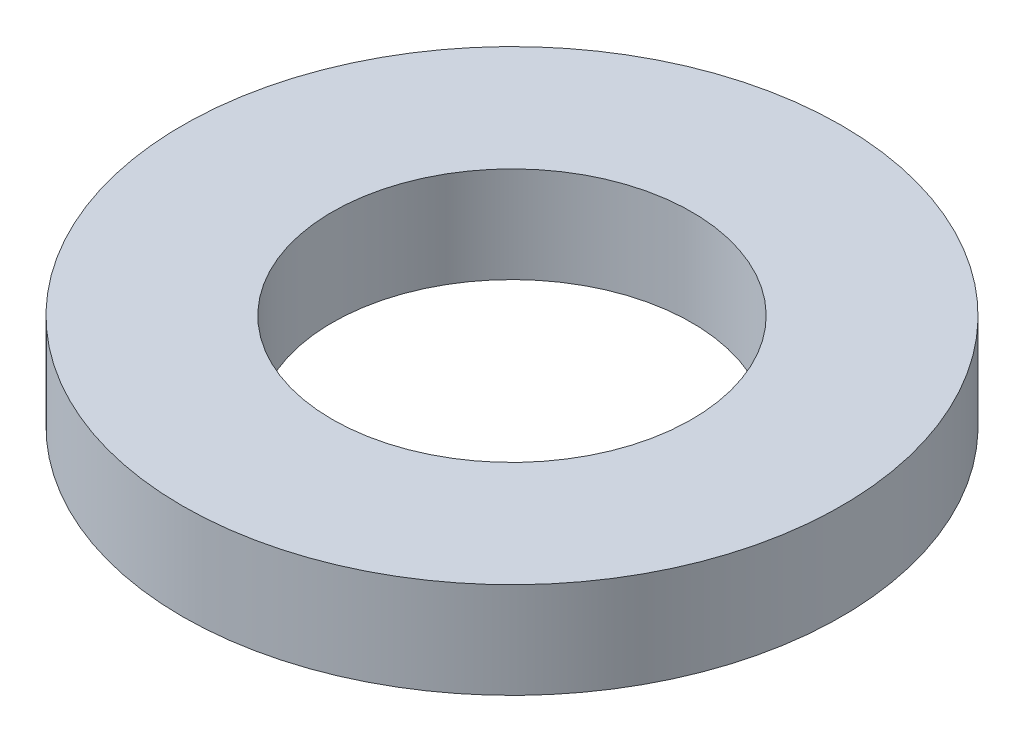
ISO-10303-21;
HEADER;
FILE_DESCRIPTION(('STEP AP214'),'2;1');
FILE_NAME('part.step','',(''),(''),'','','');
FILE_SCHEMA(('AUTOMOTIVE_DESIGN { 1 0 10303 214 1 1 1 1 }'));
ENDSEC;
DATA;
#1=APPLICATION_CONTEXT('core data for automotive mechanical design processes');
#2=APPLICATION_PROTOCOL_DEFINITION('international standard','automotive_design',2000,#1);
#3=PRODUCT_CONTEXT('',#1,'mechanical');
#4=PRODUCT('Part','Part','',(#3));
#5=PRODUCT_RELATED_PRODUCT_CATEGORY('part','',(#4));
#6=PRODUCT_DEFINITION_FORMATION('','',#4);
#7=PRODUCT_DEFINITION_CONTEXT('part definition',#1,'design');
#8=PRODUCT_DEFINITION('design','',#6,#7);
#9=PRODUCT_DEFINITION_SHAPE('','',#8);
#10=(LENGTH_UNIT() NAMED_UNIT(*) SI_UNIT(.MILLI.,.METRE.));
#11=(NAMED_UNIT(*) PLANE_ANGLE_UNIT() SI_UNIT($,.RADIAN.));
#12=(NAMED_UNIT(*) SI_UNIT($,.STERADIAN.) SOLID_ANGLE_UNIT());
#13=UNCERTAINTY_MEASURE_WITH_UNIT(LENGTH_MEASURE(1.E-05),#10,'distance_accuracy_value','');
#14=(GEOMETRIC_REPRESENTATION_CONTEXT(3) GLOBAL_UNCERTAINTY_ASSIGNED_CONTEXT((#13)) GLOBAL_UNIT_ASSIGNED_CONTEXT((#10,
#11,#12)) REPRESENTATION_CONTEXT('',''));
#15=CARTESIAN_POINT('',(0.,0.,0.));
#16=DIRECTION('',(0.,0.,1.));
#17=DIRECTION('',(1.,0.,0.));
#18=AXIS2_PLACEMENT_3D('',#15,#16,#17);
#19=CARTESIAN_POINT('',(0.,24.,0.));
#20=DIRECTION('',(0.,-1.,0.));
#21=DIRECTION('',(0.,0.,-1.));
#22=AXIS2_PLACEMENT_3D('',#19,#20,#21);
#23=CYLINDRICAL_SURFACE('',#22,82.5);
#24=CARTESIAN_POINT('',(0.,24.,0.));
#25=DIRECTION('',(0.,1.,0.));
#26=DIRECTION('',(0.,0.,1.));
#27=AXIS2_PLACEMENT_3D('',#24,#25,#26);
#28=CIRCLE('',#27,82.5);
#29=CARTESIAN_POINT('',(0.,24.,82.5));
#30=VERTEX_POINT('',#29);
#31=EDGE_CURVE('E10',#30,#30,#28,.T.);
#32=ORIENTED_EDGE('',*,*,#31,.F.);
#33=EDGE_LOOP('',(#32));
#34=FACE_BOUND('',#33,.T.);
#35=CARTESIAN_POINT('',(0.,0.,0.));
#36=DIRECTION('',(0.,1.,0.));
#37=DIRECTION('',(0.,0.,1.));
#38=AXIS2_PLACEMENT_3D('',#35,#36,#37);
#39=CIRCLE('',#38,82.5);
#40=CARTESIAN_POINT('',(0.,0.,82.5));
#41=VERTEX_POINT('',#40);
#42=EDGE_CURVE('E37',#41,#41,#39,.T.);
#43=ORIENTED_EDGE('',*,*,#42,.T.);
#44=EDGE_LOOP('',(#43));
#45=FACE_BOUND('',#44,.T.);
#46=ADVANCED_FACE('F40',(#34,#45),#23,.T.);
#47=CARTESIAN_POINT('',(0.,24.,0.));
#48=DIRECTION('',(0.,1.,0.));
#49=DIRECTION('',(0.,0.,1.));
#50=AXIS2_PLACEMENT_3D('',#47,#48,#49);
#51=PLANE('',#50);
#52=CARTESIAN_POINT('',(0.,24.,0.));
#53=DIRECTION('',(0.,1.,0.));
#54=DIRECTION('',(0.,0.,1.));
#55=AXIS2_PLACEMENT_3D('',#52,#53,#54);
#56=CIRCLE('',#55,45.);
#57=CARTESIAN_POINT('',(0.,24.,45.));
#58=VERTEX_POINT('',#57);
#59=EDGE_CURVE('E50',#58,#58,#56,.T.);
#60=ORIENTED_EDGE('',*,*,#59,.F.);
#61=EDGE_LOOP('',(#60));
#62=FACE_BOUND('',#61,.T.);
#63=ORIENTED_EDGE('',*,*,#31,.T.);
#64=EDGE_LOOP('',(#63));
#65=FACE_BOUND('',#64,.T.);
#66=ADVANCED_FACE('F59',(#62,#65),#51,.T.);
#67=CARTESIAN_POINT('',(0.,0.,0.));
#68=DIRECTION('',(0.,1.,0.));
#69=DIRECTION('',(0.,0.,1.));
#70=AXIS2_PLACEMENT_3D('',#67,#68,#69);
#71=PLANE('',#70);
#72=CARTESIAN_POINT('',(0.,0.,0.));
#73=DIRECTION('',(0.,1.,0.));
#74=DIRECTION('',(0.,0.,1.));
#75=AXIS2_PLACEMENT_3D('',#72,#73,#74);
#76=CIRCLE('',#75,45.);
#77=CARTESIAN_POINT('',(0.,0.,45.));
#78=VERTEX_POINT('',#77);
#79=EDGE_CURVE('E47',#78,#78,#76,.T.);
#80=ORIENTED_EDGE('',*,*,#79,.T.);
#81=EDGE_LOOP('',(#80));
#82=FACE_BOUND('',#81,.T.);
#83=ORIENTED_EDGE('',*,*,#42,.F.);
#84=EDGE_LOOP('',(#83));
#85=FACE_BOUND('',#84,.T.);
#86=ADVANCED_FACE('F58',(#82,#85),#71,.F.);
#87=CARTESIAN_POINT('',(0.,24.,0.));
#88=DIRECTION('',(0.,-1.,0.));
#89=DIRECTION('',(0.,0.,-1.));
#90=AXIS2_PLACEMENT_3D('',#87,#88,#89);
#91=CYLINDRICAL_SURFACE('',#90,45.);
#92=ORIENTED_EDGE('',*,*,#59,.T.);
#93=EDGE_LOOP('',(#92));
#94=FACE_BOUND('',#93,.T.);
#95=ORIENTED_EDGE('',*,*,#79,.F.);
#96=EDGE_LOOP('',(#95));
#97=FACE_BOUND('',#96,.T.);
#98=ADVANCED_FACE('F54',(#94,#97),#91,.F.);
#99=CLOSED_SHELL('',(#46,#66,#86,#98));
#100=MANIFOLD_SOLID_BREP('B2',#99);
#101=ADVANCED_BREP_SHAPE_REPRESENTATION('',(#18,#100),#14);
#102=SHAPE_DEFINITION_REPRESENTATION(#9,#101);
ENDSEC;
END-ISO-10303-21;
